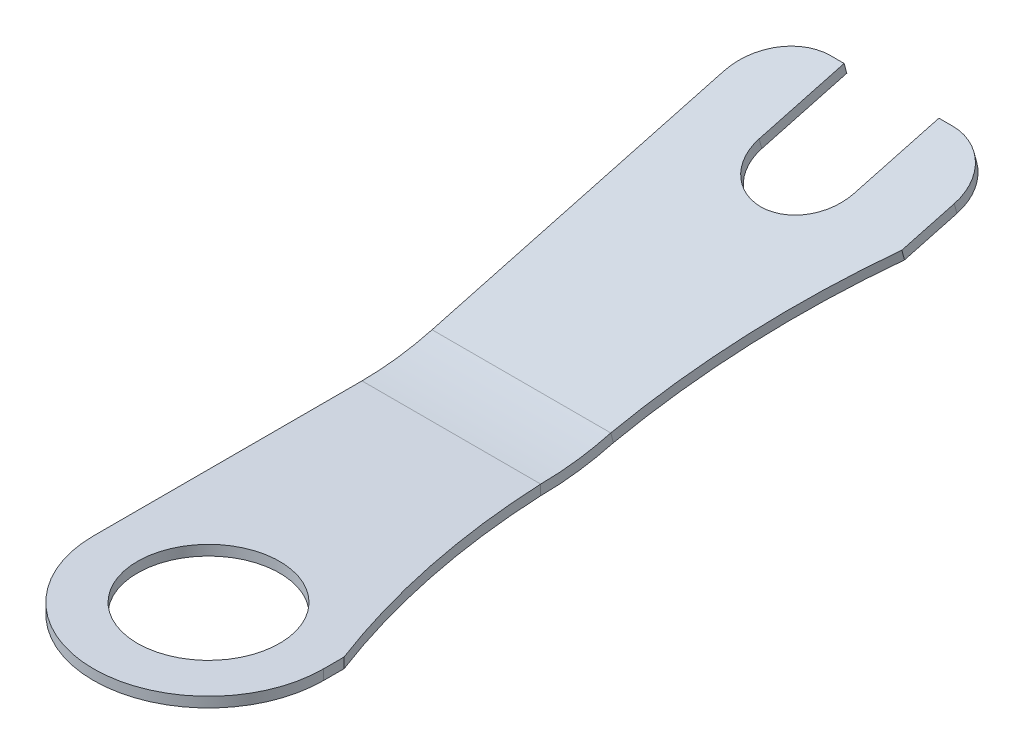
ISO-10303-21;
HEADER;
FILE_DESCRIPTION(('STEP AP214'),'2;1');
FILE_NAME('part.step','',(''),(''),'','','');
FILE_SCHEMA(('AUTOMOTIVE_DESIGN { 1 0 10303 214 1 1 1 1 }'));
ENDSEC;
DATA;
#1=APPLICATION_CONTEXT('core data for automotive mechanical design processes');
#2=APPLICATION_PROTOCOL_DEFINITION('international standard','automotive_design',2000,#1);
#3=PRODUCT_CONTEXT('',#1,'mechanical');
#4=PRODUCT('Part','Part','',(#3));
#5=PRODUCT_RELATED_PRODUCT_CATEGORY('part','',(#4));
#6=PRODUCT_DEFINITION_FORMATION('','',#4);
#7=PRODUCT_DEFINITION_CONTEXT('part definition',#1,'design');
#8=PRODUCT_DEFINITION('design','',#6,#7);
#9=PRODUCT_DEFINITION_SHAPE('','',#8);
#10=(LENGTH_UNIT() NAMED_UNIT(*) SI_UNIT(.MILLI.,.METRE.));
#11=(NAMED_UNIT(*) PLANE_ANGLE_UNIT() SI_UNIT($,.RADIAN.));
#12=(NAMED_UNIT(*) SI_UNIT($,.STERADIAN.) SOLID_ANGLE_UNIT());
#13=UNCERTAINTY_MEASURE_WITH_UNIT(LENGTH_MEASURE(1.E-05),#10,'distance_accuracy_value','');
#14=(GEOMETRIC_REPRESENTATION_CONTEXT(3) GLOBAL_UNCERTAINTY_ASSIGNED_CONTEXT((#13)) GLOBAL_UNIT_ASSIGNED_CONTEXT((#10,
#11,#12)) REPRESENTATION_CONTEXT('',''));
#15=CARTESIAN_POINT('',(0.,0.,0.));
#16=DIRECTION('',(0.,0.,1.));
#17=DIRECTION('',(1.,0.,0.));
#18=AXIS2_PLACEMENT_3D('',#15,#16,#17);
#19=CARTESIAN_POINT('',(-1.7,-1.01644729326827,-0.139953174880458));
#20=DIRECTION('',(1.,0.,0.));
#21=DIRECTION('',(0.,0.258819045102521,-0.965925826289068));
#22=AXIS2_PLACEMENT_3D('',#19,#20,#21);
#23=PLANE('',#22);
#24=DIRECTION('',(0.,-0.258819045102521,0.965925826289068));
#25=VECTOR('',#24,1.);
#26=CARTESIAN_POINT('',(-1.7,-1.16133616721163,-0.178776031645836));
#27=LINE('',#26,#25);
#28=CARTESIAN_POINT('',(-1.7,1.29744476126232,-9.35507138139198));
#29=VERTEX_POINT('',#28);
#30=CARTESIAN_POINT('',(-1.7,0.141407820900367,-5.04068278453469));
#31=VERTEX_POINT('',#30);
#32=EDGE_CURVE('E88',#29,#31,#27,.T.);
#33=ORIENTED_EDGE('',*,*,#32,.T.);
#34=DIRECTION('',(0.,0.965925826289068,0.258819045102521));
#35=VECTOR('',#34,1.);
#36=CARTESIAN_POINT('',(-1.7,0.286296694843728,-5.00185992776932));
#37=LINE('',#36,#35);
#38=CARTESIAN_POINT('',(-1.7,0.286296694843727,-5.00185992776932));
#39=VERTEX_POINT('',#38);
#40=EDGE_CURVE('E501',#31,#39,#37,.T.);
#41=ORIENTED_EDGE('',*,*,#40,.T.);
#42=DIRECTION('',(0.,-0.258819045102521,0.965925826289068));
#43=VECTOR('',#42,1.);
#44=CARTESIAN_POINT('',(-1.7,-1.01644729326827,-0.139953174880458));
#45=LINE('',#44,#43);
#46=CARTESIAN_POINT('',(-1.7,1.44233363520568,-9.3162485246266));
#47=VERTEX_POINT('',#46);
#48=EDGE_CURVE('E67',#47,#39,#45,.T.);
#49=ORIENTED_EDGE('',*,*,#48,.F.);
#50=DIRECTION('',(0.,-0.965925826289068,-0.258819045102521));
#51=VECTOR('',#50,1.);
#52=CARTESIAN_POINT('',(-1.7,1.44233363520569,-9.31624852462661));
#53=LINE('',#52,#51);
#54=EDGE_CURVE('E569',#47,#29,#53,.T.);
#55=ORIENTED_EDGE('',*,*,#54,.T.);
#56=EDGE_LOOP('',(#33,#41,#49,#55));
#57=FACE_BOUND('',#56,.T.);
#58=ADVANCED_FACE('F63',(#57),#23,.F.);
#59=CARTESIAN_POINT('',(0.,1.16803523871106,-8.87210846824745));
#60=DIRECTION('',(0.,0.965925826289068,0.258819045102521));
#61=DIRECTION('',(0.,-0.258819045102521,0.965925826289068));
#62=AXIS2_PLACEMENT_3D('',#59,#60,#61);
#63=PLANE('',#62);
#64=CARTESIAN_POINT('',(12.7279220613579,0.00334953574971861,-4.52544224994664));
#65=DIRECTION('',(0.,0.965925826289068,0.258819045102521));
#66=DIRECTION('',(0.,-0.258819045102521,0.965925826289068));
#67=AXIS2_PLACEMENT_3D('',#64,#65,#66);
#68=CIRCLE('',#67,11.8);
#69=CARTESIAN_POINT('',(1.7,1.08992524666565,-8.58059800935517));
#70=VERTEX_POINT('',#69);
#71=CARTESIAN_POINT('',(0.939984705678592,0.141407820900368,-5.0406827845347));
#72=VERTEX_POINT('',#71);
#73=EDGE_CURVE('E80',#70,#72,#68,.T.);
#74=ORIENTED_EDGE('',*,*,#73,.T.);
#75=DIRECTION('',(-1.,0.,0.));
#76=VECTOR('',#75,1.);
#77=CARTESIAN_POINT('',(0.,0.141407820900368,-5.0406827845347));
#78=LINE('',#77,#76);
#79=EDGE_CURVE('E72',#72,#31,#78,.T.);
#80=ORIENTED_EDGE('',*,*,#79,.T.);
#81=ORIENTED_EDGE('',*,*,#32,.F.);
#82=CARTESIAN_POINT('',(-0.9,1.29744476126233,-9.35507138139198));
#83=DIRECTION('',(0.,0.965925826289068,0.258819045102521));
#84=DIRECTION('',(0.,-0.258819045102521,0.965925826289068));
#85=AXIS2_PLACEMENT_3D('',#82,#83,#84);
#86=CIRCLE('',#85,0.8);
#87=CARTESIAN_POINT('',(-0.9,1.50449999734434,-10.1278120424232));
#88=VERTEX_POINT('',#87);
#89=EDGE_CURVE('E574',#29,#88,#86,.F.);
#90=ORIENTED_EDGE('',*,*,#89,.T.);
#91=DIRECTION('',(-1.,0.,0.));
#92=VECTOR('',#91,1.);
#93=CARTESIAN_POINT('',(-1.7,1.50449999734434,-10.1278120424232));
#94=LINE('',#93,#92);
#95=CARTESIAN_POINT('',(-0.7,1.50449999734434,-10.1278120424232));
#96=VERTEX_POINT('',#95);
#97=EDGE_CURVE('E551',#96,#88,#94,.T.);
#98=ORIENTED_EDGE('',*,*,#97,.F.);
#99=DIRECTION('',(0.,0.258819045102521,-0.965925826289068));
#100=VECTOR('',#99,1.);
#101=CARTESIAN_POINT('',(-0.7,1.16803523871106,-8.87210846824745));
#102=LINE('',#101,#100);
#103=CARTESIAN_POINT('',(-0.7,1.16803523871106,-8.87210846824745));
#104=VERTEX_POINT('',#103);
#105=EDGE_CURVE('E549',#104,#96,#102,.T.);
#106=ORIENTED_EDGE('',*,*,#105,.F.);
#107=CARTESIAN_POINT('',(0.,1.16803523871106,-8.87210846824745));
#108=DIRECTION('',(0.,-0.965925826289068,-0.258819045102521));
#109=DIRECTION('',(0.,-0.258819045102521,0.965925826289068));
#110=AXIS2_PLACEMENT_3D('',#107,#108,#109);
#111=CIRCLE('',#110,0.7);
#112=CARTESIAN_POINT('',(0.7,1.16803523871106,-8.87210846824745));
#113=VERTEX_POINT('',#112);
#114=EDGE_CURVE('E531',#113,#104,#111,.T.);
#115=ORIENTED_EDGE('',*,*,#114,.F.);
#116=DIRECTION('',(0.,-0.258819045102521,0.965925826289068));
#117=VECTOR('',#116,1.);
#118=CARTESIAN_POINT('',(0.7,1.16803523871106,-8.87210846824745));
#119=LINE('',#118,#117);
#120=CARTESIAN_POINT('',(0.7,1.50449999734434,-10.1278120424232));
#121=VERTEX_POINT('',#120);
#122=EDGE_CURVE('E536',#121,#113,#119,.T.);
#123=ORIENTED_EDGE('',*,*,#122,.F.);
#124=DIRECTION('',(-1.,0.,0.));
#125=VECTOR('',#124,1.);
#126=CARTESIAN_POINT('',(0.7,1.50449999734434,-10.1278120424232));
#127=LINE('',#126,#125);
#128=CARTESIAN_POINT('',(0.9,1.50449999734434,-10.1278120424232));
#129=VERTEX_POINT('',#128);
#130=EDGE_CURVE('E554',#129,#121,#127,.T.);
#131=ORIENTED_EDGE('',*,*,#130,.F.);
#132=CARTESIAN_POINT('',(0.9,1.29744476126233,-9.35507138139198));
#133=DIRECTION('',(0.,0.965925826289068,0.258819045102521));
#134=DIRECTION('',(0.,-0.258819045102521,0.965925826289068));
#135=AXIS2_PLACEMENT_3D('',#132,#133,#134);
#136=CIRCLE('',#135,0.8);
#137=CARTESIAN_POINT('',(1.7,1.29744476126232,-9.35507138139198));
#138=VERTEX_POINT('',#137);
#139=EDGE_CURVE('E571',#129,#138,#136,.F.);
#140=ORIENTED_EDGE('',*,*,#139,.T.);
#141=DIRECTION('',(0.,0.258819045102521,-0.965925826289068));
#142=VECTOR('',#141,1.);
#143=CARTESIAN_POINT('',(1.7,-1.16133616721163,-0.178776031645836));
#144=LINE('',#143,#142);
#145=EDGE_CURVE('E556',#70,#138,#144,.T.);
#146=ORIENTED_EDGE('',*,*,#145,.F.);
#147=EDGE_LOOP('',(#74,#80,#81,#90,#98,#106,#115,#123,#131,#140,#146));
#148=FACE_BOUND('',#147,.T.);
#149=ADVANCED_FACE('F305',(#148),#63,.F.);
#150=CARTESIAN_POINT('',(1.7,-1.01644729326827,-0.139953174880458));
#151=DIRECTION('',(-1.,0.,0.));
#152=DIRECTION('',(0.,-0.258819045102521,0.965925826289068));
#153=AXIS2_PLACEMENT_3D('',#150,#151,#152);
#154=PLANE('',#153);
#155=DIRECTION('',(0.,0.965925826289068,0.258819045102521));
#156=VECTOR('',#155,1.);
#157=CARTESIAN_POINT('',(1.7,1.23481412060901,-8.5417751525898));
#158=LINE('',#157,#156);
#159=CARTESIAN_POINT('',(1.7,1.23481412060901,-8.5417751525898));
#160=VERTEX_POINT('',#159);
#161=EDGE_CURVE('E529',#160,#70,#158,.F.);
#162=ORIENTED_EDGE('',*,*,#161,.T.);
#163=ORIENTED_EDGE('',*,*,#145,.T.);
#164=DIRECTION('',(0.,-0.965925826289068,-0.258819045102521));
#165=VECTOR('',#164,1.);
#166=CARTESIAN_POINT('',(1.7,1.44233363520569,-9.31624852462661));
#167=LINE('',#166,#165);
#168=CARTESIAN_POINT('',(1.7,1.44233363520568,-9.3162485246266));
#169=VERTEX_POINT('',#168);
#170=EDGE_CURVE('E585',#138,#169,#167,.F.);
#171=ORIENTED_EDGE('',*,*,#170,.T.);
#172=DIRECTION('',(0.,0.258819045102521,-0.965925826289068));
#173=VECTOR('',#172,1.);
#174=CARTESIAN_POINT('',(1.7,-1.01644729326827,-0.139953174880458));
#175=LINE('',#174,#173);
#176=EDGE_CURVE('E544',#160,#169,#175,.T.);
#177=ORIENTED_EDGE('',*,*,#176,.F.);
#178=EDGE_LOOP('',(#162,#163,#171,#177));
#179=FACE_BOUND('',#178,.T.);
#180=ADVANCED_FACE('F302',(#179),#154,.F.);
#181=CARTESIAN_POINT('',(0.,1.31292411265442,-8.83328561148207));
#182=DIRECTION('',(0.,0.965925826289068,0.258819045102521));
#183=DIRECTION('',(0.,-0.258819045102521,0.965925826289068));
#184=AXIS2_PLACEMENT_3D('',#181,#182,#183);
#185=PLANE('',#184);
#186=DIRECTION('',(-1.,0.,0.));
#187=VECTOR('',#186,1.);
#188=CARTESIAN_POINT('',(0.,0.286296694843728,-5.00185992776932));
#189=LINE('',#188,#187);
#190=CARTESIAN_POINT('',(0.939984705678592,0.286296694843728,-5.00185992776932));
#191=VERTEX_POINT('',#190);
#192=EDGE_CURVE('E216',#191,#39,#189,.T.);
#193=ORIENTED_EDGE('',*,*,#192,.F.);
#194=CARTESIAN_POINT('',(12.7279220613579,0.148238409693079,-4.48661939318126));
#195=DIRECTION('',(0.,0.965925826289068,0.258819045102521));
#196=DIRECTION('',(0.,-0.258819045102521,0.965925826289068));
#197=AXIS2_PLACEMENT_3D('',#194,#195,#196);
#198=CIRCLE('',#197,11.8);
#199=EDGE_CURVE('E499',#160,#191,#198,.T.);
#200=ORIENTED_EDGE('',*,*,#199,.F.);
#201=ORIENTED_EDGE('',*,*,#176,.T.);
#202=CARTESIAN_POINT('',(0.9,1.44233363520569,-9.31624852462661));
#203=DIRECTION('',(0.,0.965925826289068,0.258819045102521));
#204=DIRECTION('',(0.,-0.258819045102521,0.965925826289068));
#205=AXIS2_PLACEMENT_3D('',#202,#203,#204);
#206=CIRCLE('',#205,0.8);
#207=CARTESIAN_POINT('',(0.9,1.6493888712877,-10.0889891856579));
#208=VERTEX_POINT('',#207);
#209=EDGE_CURVE('E578',#169,#208,#206,.T.);
#210=ORIENTED_EDGE('',*,*,#209,.T.);
#211=DIRECTION('',(-1.,0.,0.));
#212=VECTOR('',#211,1.);
#213=CARTESIAN_POINT('',(0.7,1.6493888712877,-10.0889891856579));
#214=LINE('',#213,#212);
#215=CARTESIAN_POINT('',(0.7,1.6493888712877,-10.0889891856579));
#216=VERTEX_POINT('',#215);
#217=EDGE_CURVE('E541',#208,#216,#214,.T.);
#218=ORIENTED_EDGE('',*,*,#217,.T.);
#219=DIRECTION('',(0.,-0.258819045102521,0.965925826289068));
#220=VECTOR('',#219,1.);
#221=CARTESIAN_POINT('',(0.7,1.31292411265442,-8.83328561148207));
#222=LINE('',#221,#220);
#223=CARTESIAN_POINT('',(0.7,1.31292411265442,-8.83328561148207));
#224=VERTEX_POINT('',#223);
#225=EDGE_CURVE('E543',#216,#224,#222,.T.);
#226=ORIENTED_EDGE('',*,*,#225,.T.);
#227=CARTESIAN_POINT('',(0.,1.31292411265442,-8.83328561148207));
#228=DIRECTION('',(0.,-0.965925826289068,-0.258819045102521));
#229=DIRECTION('',(0.,-0.258819045102521,0.965925826289068));
#230=AXIS2_PLACEMENT_3D('',#227,#228,#229);
#231=CIRCLE('',#230,0.7);
#232=CARTESIAN_POINT('',(-0.7,1.31292411265442,-8.83328561148207));
#233=VERTEX_POINT('',#232);
#234=EDGE_CURVE('E532',#224,#233,#231,.T.);
#235=ORIENTED_EDGE('',*,*,#234,.T.);
#236=DIRECTION('',(0.,0.258819045102521,-0.965925826289068));
#237=VECTOR('',#236,1.);
#238=CARTESIAN_POINT('',(-0.7,1.31292411265442,-8.83328561148207));
#239=LINE('',#238,#237);
#240=CARTESIAN_POINT('',(-0.7,1.6493888712877,-10.0889891856579));
#241=VERTEX_POINT('',#240);
#242=EDGE_CURVE('E535',#233,#241,#239,.T.);
#243=ORIENTED_EDGE('',*,*,#242,.T.);
#244=DIRECTION('',(-1.,0.,0.));
#245=VECTOR('',#244,1.);
#246=CARTESIAN_POINT('',(-1.7,1.6493888712877,-10.0889891856579));
#247=LINE('',#246,#245);
#248=CARTESIAN_POINT('',(-0.9,1.6493888712877,-10.0889891856579));
#249=VERTEX_POINT('',#248);
#250=EDGE_CURVE('E538',#241,#249,#247,.T.);
#251=ORIENTED_EDGE('',*,*,#250,.T.);
#252=CARTESIAN_POINT('',(-0.9,1.44233363520569,-9.31624852462661));
#253=DIRECTION('',(0.,0.965925826289068,0.258819045102521));
#254=DIRECTION('',(0.,-0.258819045102521,0.965925826289068));
#255=AXIS2_PLACEMENT_3D('',#252,#253,#254);
#256=CIRCLE('',#255,0.8);
#257=EDGE_CURVE('E580',#249,#47,#256,.T.);
#258=ORIENTED_EDGE('',*,*,#257,.T.);
#259=ORIENTED_EDGE('',*,*,#48,.T.);
#260=EDGE_LOOP('',(#193,#200,#201,#210,#218,#226,#235,#243,#251,#258,#259));
#261=FACE_BOUND('',#260,.T.);
#262=ADVANCED_FACE('F293',(#261),#185,.T.);
#263=CARTESIAN_POINT('',(0.,1.31292411265442,-8.83328561148207));
#264=DIRECTION('',(0.,-0.965925826289068,-0.258819045102521));
#265=DIRECTION('',(0.,0.258819045102521,-0.965925826289068));
#266=AXIS2_PLACEMENT_3D('',#263,#264,#265);
#267=CYLINDRICAL_SURFACE('',#266,0.7);
#268=ORIENTED_EDGE('',*,*,#114,.T.);
#269=DIRECTION('',(0.,-0.965925826289068,-0.258819045102521));
#270=VECTOR('',#269,1.);
#271=CARTESIAN_POINT('',(-0.7,1.31292411265442,-8.83328561148207));
#272=LINE('',#271,#270);
#273=EDGE_CURVE('E566',#233,#104,#272,.T.);
#274=ORIENTED_EDGE('',*,*,#273,.F.);
#275=ORIENTED_EDGE('',*,*,#234,.F.);
#276=DIRECTION('',(0.,-0.965925826289068,-0.258819045102521));
#277=VECTOR('',#276,1.);
#278=CARTESIAN_POINT('',(0.7,1.31292411265442,-8.83328561148207));
#279=LINE('',#278,#277);
#280=EDGE_CURVE('E546',#224,#113,#279,.T.);
#281=ORIENTED_EDGE('',*,*,#280,.T.);
#282=EDGE_LOOP('',(#268,#274,#275,#281));
#283=FACE_BOUND('',#282,.T.);
#284=ADVANCED_FACE('F289',(#283),#267,.F.);
#285=CARTESIAN_POINT('',(-0.7,1.31292411265442,-8.83328561148207));
#286=DIRECTION('',(-1.,0.,0.));
#287=DIRECTION('',(0.,-0.258819045102521,0.965925826289068));
#288=AXIS2_PLACEMENT_3D('',#285,#286,#287);
#289=PLANE('',#288);
#290=ORIENTED_EDGE('',*,*,#105,.T.);
#291=DIRECTION('',(0.,-0.965925826289068,-0.258819045102521));
#292=VECTOR('',#291,1.);
#293=CARTESIAN_POINT('',(-0.7,1.6493888712877,-10.0889891856579));
#294=LINE('',#293,#292);
#295=EDGE_CURVE('E563',#241,#96,#294,.T.);
#296=ORIENTED_EDGE('',*,*,#295,.F.);
#297=ORIENTED_EDGE('',*,*,#242,.F.);
#298=ORIENTED_EDGE('',*,*,#273,.T.);
#299=EDGE_LOOP('',(#290,#296,#297,#298));
#300=FACE_BOUND('',#299,.T.);
#301=ADVANCED_FACE('F285',(#300),#289,.F.);
#302=CARTESIAN_POINT('',(-1.7,1.6493888712877,-10.0889891856579));
#303=DIRECTION('',(0.,-0.258819045102521,0.965925826289068));
#304=DIRECTION('',(1.,0.,0.));
#305=AXIS2_PLACEMENT_3D('',#302,#303,#304);
#306=PLANE('',#305);
#307=ORIENTED_EDGE('',*,*,#97,.T.);
#308=DIRECTION('',(0.,-0.965925826289068,-0.258819045102521));
#309=VECTOR('',#308,1.);
#310=CARTESIAN_POINT('',(-0.9,1.6493888712877,-10.0889891856579));
#311=LINE('',#310,#309);
#312=EDGE_CURVE('E576',#88,#249,#311,.F.);
#313=ORIENTED_EDGE('',*,*,#312,.T.);
#314=ORIENTED_EDGE('',*,*,#250,.F.);
#315=ORIENTED_EDGE('',*,*,#295,.T.);
#316=EDGE_LOOP('',(#307,#313,#314,#315));
#317=FACE_BOUND('',#316,.T.);
#318=ADVANCED_FACE('F281',(#317),#306,.F.);
#319=CARTESIAN_POINT('',(0.7,1.6493888712877,-10.0889891856579));
#320=DIRECTION('',(0.,-0.258819045102521,0.965925826289068));
#321=DIRECTION('',(1.,0.,0.));
#322=AXIS2_PLACEMENT_3D('',#319,#320,#321);
#323=PLANE('',#322);
#324=ORIENTED_EDGE('',*,*,#217,.F.);
#325=DIRECTION('',(0.,-0.965925826289068,-0.258819045102521));
#326=VECTOR('',#325,1.);
#327=CARTESIAN_POINT('',(0.9,1.6493888712877,-10.0889891856579));
#328=LINE('',#327,#326);
#329=EDGE_CURVE('E582',#208,#129,#328,.T.);
#330=ORIENTED_EDGE('',*,*,#329,.T.);
#331=ORIENTED_EDGE('',*,*,#130,.T.);
#332=DIRECTION('',(0.,-0.965925826289068,-0.258819045102521));
#333=VECTOR('',#332,1.);
#334=CARTESIAN_POINT('',(0.7,1.6493888712877,-10.0889891856579));
#335=LINE('',#334,#333);
#336=EDGE_CURVE('E560',#216,#121,#335,.T.);
#337=ORIENTED_EDGE('',*,*,#336,.F.);
#338=EDGE_LOOP('',(#324,#330,#331,#337));
#339=FACE_BOUND('',#338,.T.);
#340=ADVANCED_FACE('F277',(#339),#323,.F.);
#341=CARTESIAN_POINT('',(0.7,1.31292411265442,-8.83328561148207));
#342=DIRECTION('',(1.,0.,0.));
#343=DIRECTION('',(0.,0.258819045102521,-0.965925826289068));
#344=AXIS2_PLACEMENT_3D('',#341,#342,#343);
#345=PLANE('',#344);
#346=ORIENTED_EDGE('',*,*,#122,.T.);
#347=ORIENTED_EDGE('',*,*,#280,.F.);
#348=ORIENTED_EDGE('',*,*,#225,.F.);
#349=ORIENTED_EDGE('',*,*,#336,.T.);
#350=EDGE_LOOP('',(#346,#347,#348,#349));
#351=FACE_BOUND('',#350,.T.);
#352=ADVANCED_FACE('F273',(#351),#345,.F.);
#353=CARTESIAN_POINT('',(-0.9,1.44233363520569,-9.31624852462661));
#354=DIRECTION('',(0.,-0.965925826289068,-0.258819045102521));
#355=DIRECTION('',(0.,0.258819045102521,-0.965925826289068));
#356=AXIS2_PLACEMENT_3D('',#353,#354,#355);
#357=CYLINDRICAL_SURFACE('',#356,0.8);
#358=ORIENTED_EDGE('',*,*,#257,.F.);
#359=ORIENTED_EDGE('',*,*,#312,.F.);
#360=ORIENTED_EDGE('',*,*,#89,.F.);
#361=ORIENTED_EDGE('',*,*,#54,.F.);
#362=EDGE_LOOP('',(#358,#359,#360,#361));
#363=FACE_BOUND('',#362,.T.);
#364=ADVANCED_FACE('F276',(#363),#357,.T.);
#365=CARTESIAN_POINT('',(0.9,1.44233363520569,-9.31624852462661));
#366=DIRECTION('',(0.,-0.965925826289068,-0.258819045102521));
#367=DIRECTION('',(0.,0.258819045102521,-0.965925826289068));
#368=AXIS2_PLACEMENT_3D('',#365,#366,#367);
#369=CYLINDRICAL_SURFACE('',#368,0.8);
#370=ORIENTED_EDGE('',*,*,#209,.F.);
#371=ORIENTED_EDGE('',*,*,#170,.F.);
#372=ORIENTED_EDGE('',*,*,#139,.F.);
#373=ORIENTED_EDGE('',*,*,#329,.F.);
#374=EDGE_LOOP('',(#370,#371,#372,#373));
#375=FACE_BOUND('',#374,.T.);
#376=ADVANCED_FACE('F297',(#375),#369,.T.);
#377=CARTESIAN_POINT('',(12.7279220613579,0.148238409693079,-4.48661939318126));
#378=DIRECTION('',(0.,0.965925826289068,0.258819045102521));
#379=DIRECTION('',(0.,-0.258819045102521,0.965925826289068));
#380=AXIS2_PLACEMENT_3D('',#377,#378,#379);
#381=CYLINDRICAL_SURFACE('',#380,11.8);
#382=DIRECTION('',(0.,0.965925826289068,0.258819045102521));
#383=VECTOR('',#382,1.);
#384=CARTESIAN_POINT('',(0.93998470567859,0.286296694843728,-5.00185992776932));
#385=LINE('',#384,#383);
#386=EDGE_CURVE('E14',#72,#191,#385,.T.);
#387=ORIENTED_EDGE('',*,*,#386,.F.);
#388=ORIENTED_EDGE('',*,*,#73,.F.);
#389=ORIENTED_EDGE('',*,*,#161,.F.);
#390=ORIENTED_EDGE('',*,*,#199,.T.);
#391=EDGE_LOOP('',(#387,#388,#389,#390));
#392=FACE_BOUND('',#391,.T.);
#393=ADVANCED_FACE('F65',(#392),#381,.F.);
#394=CARTESIAN_POINT('',(1.7,0.15,0.));
#395=DIRECTION('',(-1.,0.,0.));
#396=DIRECTION('',(0.,0.,1.));
#397=AXIS2_PLACEMENT_3D('',#394,#395,#396);
#398=PLANE('',#397);
#399=DIRECTION('',(0.,1.,0.));
#400=VECTOR('',#399,1.);
#401=CARTESIAN_POINT('',(1.7,0.15,-0.301793834431583));
#402=LINE('',#401,#400);
#403=CARTESIAN_POINT('',(1.7,0.15,-0.301793834431583));
#404=VERTEX_POINT('',#403);
#405=CARTESIAN_POINT('',(1.7,0.,-0.301793834431583));
#406=VERTEX_POINT('',#405);
#407=EDGE_CURVE('E507',#404,#406,#402,.F.);
#408=ORIENTED_EDGE('',*,*,#407,.F.);
#409=DIRECTION('',(0.,0.,-1.));
#410=VECTOR('',#409,1.);
#411=CARTESIAN_POINT('',(1.7,0.15,0.));
#412=LINE('',#411,#410);
#413=CARTESIAN_POINT('',(1.7,0.15,0.));
#414=VERTEX_POINT('',#413);
#415=EDGE_CURVE('E516',#414,#404,#412,.T.);
#416=ORIENTED_EDGE('',*,*,#415,.F.);
#417=DIRECTION('',(0.,-1.,0.));
#418=VECTOR('',#417,1.);
#419=CARTESIAN_POINT('',(1.7,0.15,0.));
#420=LINE('',#419,#418);
#421=CARTESIAN_POINT('',(1.7,0.,0.));
#422=VERTEX_POINT('',#421);
#423=EDGE_CURVE('E211',#414,#422,#420,.T.);
#424=ORIENTED_EDGE('',*,*,#423,.T.);
#425=DIRECTION('',(0.,0.,-1.));
#426=VECTOR('',#425,1.);
#427=CARTESIAN_POINT('',(1.7,0.,0.));
#428=LINE('',#427,#426);
#429=EDGE_CURVE('E524',#422,#406,#428,.T.);
#430=ORIENTED_EDGE('',*,*,#429,.T.);
#431=EDGE_LOOP('',(#408,#416,#424,#430));
#432=FACE_BOUND('',#431,.T.);
#433=ADVANCED_FACE('F249',(#432),#398,.F.);
#434=CARTESIAN_POINT('',(0.,0.15,0.));
#435=DIRECTION('',(0.,-1.,0.));
#436=DIRECTION('',(0.,0.,-1.));
#437=AXIS2_PLACEMENT_3D('',#434,#435,#436);
#438=CYLINDRICAL_SURFACE('',#437,1.7);
#439=CARTESIAN_POINT('',(0.,0.,0.));
#440=DIRECTION('',(0.,1.,0.));
#441=DIRECTION('',(0.,0.,1.));
#442=AXIS2_PLACEMENT_3D('',#439,#440,#441);
#443=CIRCLE('',#442,1.7);
#444=CARTESIAN_POINT('',(-1.7,0.,0.));
#445=VERTEX_POINT('',#444);
#446=EDGE_CURVE('E522',#445,#422,#443,.T.);
#447=ORIENTED_EDGE('',*,*,#446,.T.);
#448=ORIENTED_EDGE('',*,*,#423,.F.);
#449=CARTESIAN_POINT('',(0.,0.15,0.));
#450=DIRECTION('',(0.,1.,0.));
#451=DIRECTION('',(0.,0.,1.));
#452=AXIS2_PLACEMENT_3D('',#449,#450,#451);
#453=CIRCLE('',#452,1.7);
#454=CARTESIAN_POINT('',(-1.7,0.15,0.));
#455=VERTEX_POINT('',#454);
#456=EDGE_CURVE('E189',#455,#414,#453,.T.);
#457=ORIENTED_EDGE('',*,*,#456,.F.);
#458=DIRECTION('',(0.,-1.,0.));
#459=VECTOR('',#458,1.);
#460=CARTESIAN_POINT('',(-1.7,0.15,0.));
#461=LINE('',#460,#459);
#462=EDGE_CURVE('E186',#455,#445,#461,.T.);
#463=ORIENTED_EDGE('',*,*,#462,.T.);
#464=EDGE_LOOP('',(#447,#448,#457,#463));
#465=FACE_BOUND('',#464,.T.);
#466=ADVANCED_FACE('F252',(#465),#438,.T.);
#467=CARTESIAN_POINT('',(0.,0.15,0.));
#468=DIRECTION('',(0.,-1.,0.));
#469=DIRECTION('',(0.,0.,-1.));
#470=AXIS2_PLACEMENT_3D('',#467,#468,#469);
#471=CYLINDRICAL_SURFACE('',#470,1.05);
#472=CARTESIAN_POINT('',(0.,0.15,0.));
#473=DIRECTION('',(0.,1.,0.));
#474=DIRECTION('',(0.,0.,1.));
#475=AXIS2_PLACEMENT_3D('',#472,#473,#474);
#476=CIRCLE('',#475,1.05);
#477=CARTESIAN_POINT('',(0.,0.15,1.05));
#478=VERTEX_POINT('',#477);
#479=EDGE_CURVE('E201',#478,#478,#476,.T.);
#480=ORIENTED_EDGE('',*,*,#479,.T.);
#481=EDGE_LOOP('',(#480));
#482=FACE_BOUND('',#481,.T.);
#483=CARTESIAN_POINT('',(0.,0.,0.));
#484=DIRECTION('',(0.,1.,0.));
#485=DIRECTION('',(0.,0.,1.));
#486=AXIS2_PLACEMENT_3D('',#483,#484,#485);
#487=CIRCLE('',#486,1.05);
#488=CARTESIAN_POINT('',(0.,0.,1.05));
#489=VERTEX_POINT('',#488);
#490=EDGE_CURVE('E505',#489,#489,#487,.T.);
#491=ORIENTED_EDGE('',*,*,#490,.F.);
#492=EDGE_LOOP('',(#491));
#493=FACE_BOUND('',#492,.T.);
#494=ADVANCED_FACE('F256',(#482,#493),#471,.F.);
#495=CARTESIAN_POINT('',(0.,0.15,-9.));
#496=DIRECTION('',(0.,1.,0.));
#497=DIRECTION('',(0.,0.,1.));
#498=AXIS2_PLACEMENT_3D('',#495,#496,#497);
#499=PLANE('',#498);
#500=ORIENTED_EDGE('',*,*,#479,.F.);
#501=EDGE_LOOP('',(#500));
#502=FACE_BOUND('',#501,.T.);
#503=CARTESIAN_POINT('',(12.7279220613579,0.15,-4.5));
#504=DIRECTION('',(0.,1.,0.));
#505=DIRECTION('',(0.,0.,1.));
#506=AXIS2_PLACEMENT_3D('',#503,#504,#505);
#507=CIRCLE('',#506,11.8);
#508=CARTESIAN_POINT('',(0.93998470567859,0.15,-3.96658374735923));
#509=VERTEX_POINT('',#508);
#510=EDGE_CURVE('E195',#509,#404,#507,.T.);
#511=ORIENTED_EDGE('',*,*,#510,.F.);
#512=DIRECTION('',(-1.,0.,0.));
#513=VECTOR('',#512,1.);
#514=CARTESIAN_POINT('',(0.,0.15,-3.96658374735923));
#515=LINE('',#514,#513);
#516=CARTESIAN_POINT('',(-1.7,0.15,-3.96658374735923));
#517=VERTEX_POINT('',#516);
#518=EDGE_CURVE('E190',#509,#517,#515,.T.);
#519=ORIENTED_EDGE('',*,*,#518,.T.);
#520=DIRECTION('',(0.,0.,1.));
#521=VECTOR('',#520,1.);
#522=CARTESIAN_POINT('',(-1.7,0.15,0.));
#523=LINE('',#522,#521);
#524=EDGE_CURVE('E179',#517,#455,#523,.T.);
#525=ORIENTED_EDGE('',*,*,#524,.T.);
#526=ORIENTED_EDGE('',*,*,#456,.T.);
#527=ORIENTED_EDGE('',*,*,#415,.T.);
#528=EDGE_LOOP('',(#511,#519,#525,#526,#527));
#529=FACE_BOUND('',#528,.T.);
#530=ADVANCED_FACE('F193',(#502,#529),#499,.T.);
#531=CARTESIAN_POINT('',(-1.7,0.15,0.));
#532=DIRECTION('',(1.,0.,0.));
#533=DIRECTION('',(0.,0.,-1.));
#534=AXIS2_PLACEMENT_3D('',#531,#532,#533);
#535=PLANE('',#534);
#536=DIRECTION('',(0.,1.,0.));
#537=VECTOR('',#536,1.);
#538=CARTESIAN_POINT('',(-1.7,0.15,-3.96658374735923));
#539=LINE('',#538,#537);
#540=CARTESIAN_POINT('',(-1.7,0.,-3.96658374735923));
#541=VERTEX_POINT('',#540);
#542=EDGE_CURVE('E183',#541,#517,#539,.T.);
#543=ORIENTED_EDGE('',*,*,#542,.F.);
#544=DIRECTION('',(0.,0.,1.));
#545=VECTOR('',#544,1.);
#546=CARTESIAN_POINT('',(-1.7,0.,0.));
#547=LINE('',#546,#545);
#548=EDGE_CURVE('E514',#541,#445,#547,.T.);
#549=ORIENTED_EDGE('',*,*,#548,.T.);
#550=ORIENTED_EDGE('',*,*,#462,.F.);
#551=ORIENTED_EDGE('',*,*,#524,.F.);
#552=EDGE_LOOP('',(#543,#549,#550,#551));
#553=FACE_BOUND('',#552,.T.);
#554=ADVANCED_FACE('F181',(#553),#535,.F.);
#555=CARTESIAN_POINT('',(0.,0.,-9.));
#556=DIRECTION('',(0.,1.,0.));
#557=DIRECTION('',(0.,0.,1.));
#558=AXIS2_PLACEMENT_3D('',#555,#556,#557);
#559=PLANE('',#558);
#560=DIRECTION('',(-1.,0.,0.));
#561=VECTOR('',#560,1.);
#562=CARTESIAN_POINT('',(0.,0.,-3.96658374735923));
#563=LINE('',#562,#561);
#564=CARTESIAN_POINT('',(0.93998470567859,0.,-3.96658374735923));
#565=VERTEX_POINT('',#564);
#566=EDGE_CURVE('E212',#565,#541,#563,.T.);
#567=ORIENTED_EDGE('',*,*,#566,.F.);
#568=CARTESIAN_POINT('',(12.7279220613579,0.,-4.5));
#569=DIRECTION('',(0.,1.,0.));
#570=DIRECTION('',(0.,0.,1.));
#571=AXIS2_PLACEMENT_3D('',#568,#569,#570);
#572=CIRCLE('',#571,11.8);
#573=EDGE_CURVE('E510',#565,#406,#572,.T.);
#574=ORIENTED_EDGE('',*,*,#573,.T.);
#575=ORIENTED_EDGE('',*,*,#429,.F.);
#576=ORIENTED_EDGE('',*,*,#446,.F.);
#577=ORIENTED_EDGE('',*,*,#548,.F.);
#578=EDGE_LOOP('',(#567,#574,#575,#576,#577));
#579=FACE_BOUND('',#578,.T.);
#580=ORIENTED_EDGE('',*,*,#490,.T.);
#581=EDGE_LOOP('',(#580));
#582=FACE_BOUND('',#581,.T.);
#583=ADVANCED_FACE('F266',(#579,#582),#559,.F.);
#584=CARTESIAN_POINT('',(12.7279220613579,0.15,-4.5));
#585=DIRECTION('',(0.,1.,0.));
#586=DIRECTION('',(0.,0.,1.));
#587=AXIS2_PLACEMENT_3D('',#584,#585,#586);
#588=CYLINDRICAL_SURFACE('',#587,11.8);
#589=ORIENTED_EDGE('',*,*,#573,.F.);
#590=DIRECTION('',(0.,1.,0.));
#591=VECTOR('',#590,1.);
#592=CARTESIAN_POINT('',(0.93998470567859,0.15,-3.96658374735923));
#593=LINE('',#592,#591);
#594=EDGE_CURVE('E504',#565,#509,#593,.T.);
#595=ORIENTED_EDGE('',*,*,#594,.T.);
#596=ORIENTED_EDGE('',*,*,#510,.T.);
#597=ORIENTED_EDGE('',*,*,#407,.T.);
#598=EDGE_LOOP('',(#589,#595,#596,#597));
#599=FACE_BOUND('',#598,.T.);
#600=ADVANCED_FACE('F245',(#599),#588,.F.);
#601=CARTESIAN_POINT('',(0.93998470567859,4.15,-3.96658374735923));
#602=DIRECTION('',(1.,0.,0.));
#603=DIRECTION('',(0.,0.,-1.));
#604=AXIS2_PLACEMENT_3D('',#601,#602,#603);
#605=PLANE('',#604);
#606=ORIENTED_EDGE('',*,*,#594,.F.);
#607=CARTESIAN_POINT('',(0.93998470567859,0.,-3.96658374735923));
#608=CARTESIAN_POINT('',(0.93998470567859,-2.84607707107621E-07,-4.0118532338394));
#609=CARTESIAN_POINT('',(0.93998470567859,0.000740709964884903,-4.05712270421414));
#610=CARTESIAN_POINT('',(0.93998470567859,0.00370321398127928,-4.14761317792507));
#611=CARTESIAN_POINT('',(0.93998470567859,0.00592472342508166,-4.19283418126126));
#612=CARTESIAN_POINT('',(0.93998470567859,0.0118462136945089,-4.28317928606739));
#613=CARTESIAN_POINT('',(0.93998470567859,0.0155461945201337,-4.32830338753734));
#614=CARTESIAN_POINT('',(0.93998470567859,0.0244205741006329,-4.41840637191648));
#615=CARTESIAN_POINT('',(0.93998470567859,0.0295949728555073,-4.46338525482568));
#616=CARTESIAN_POINT('',(0.93998470567859,0.0414126777418669,-4.55314963531922));
#617=CARTESIAN_POINT('',(0.93998470567859,0.0480559838733522,-4.59793513290356));
#618=CARTESIAN_POINT('',(0.93998470567859,0.0628043598221529,-4.68726479099));
#619=CARTESIAN_POINT('',(0.93998470567859,0.0709094296394683,-4.73180895149209));
#620=CARTESIAN_POINT('',(0.93998470567859,0.088572743013721,-4.82060821596025));
#621=CARTESIAN_POINT('',(0.93998470567859,0.0981309865706582,-4.86486331992631));
#622=CARTESIAN_POINT('',(0.93998470567859,0.118690085427476,-4.95303715797746));
#623=CARTESIAN_POINT('',(0.93998470567859,0.129690940727356,-4.99695589206256));
#624=CARTESIAN_POINT('',(0.93998470567859,0.141407820900368,-5.0406827845347));
#625=B_SPLINE_CURVE_WITH_KNOTS('',3,(#607,#608,#609,#610,#611,#612,#613,#614,#615,#616,#617,
#618,#619,#620,#621,#622,#623,#624),.UNSPECIFIED.,.F.,.F.,(4,2,2,2,2,2,2,2,4),(0.,
0.135802372499841,0.271604744999682,0.407407117499523,0.543209489999364,0.679011862499205,
0.814814234999046,0.950616607498887,1.08641897999873),.UNSPECIFIED.);
#626=EDGE_CURVE('E225',#565,#72,#625,.T.);
#627=ORIENTED_EDGE('',*,*,#626,.T.);
#628=ORIENTED_EDGE('',*,*,#386,.T.);
#629=CARTESIAN_POINT('',(0.93998470567859,0.15,-3.96658374735923));
#630=CARTESIAN_POINT('',(0.93998470567859,0.149999725679318,-4.01021698734011));
#631=CARTESIAN_POINT('',(0.93998470567859,0.150713937315552,-4.0538502117977));
#632=CARTESIAN_POINT('',(0.93998470567859,0.153569362873522,-4.14106994549498));
#633=CARTESIAN_POINT('',(0.93998470567859,0.15571057679526,-4.18465645473468));
#634=CARTESIAN_POINT('',(0.93998470567859,0.161418037295912,-4.27173607382493));
#635=CARTESIAN_POINT('',(0.93998470567859,0.164984283874827,-4.31522918367548));
#636=CARTESIAN_POINT('',(0.93998470567859,0.173537902747598,-4.40207543367947));
#637=CARTESIAN_POINT('',(0.93998470567859,0.178525275041453,-4.44542857383292));
#638=CARTESIAN_POINT('',(0.93998470567859,0.189915833968065,-4.53194845864597));
#639=CARTESIAN_POINT('',(0.93998470567859,0.196319020600822,-4.57511520330557));
#640=CARTESIAN_POINT('',(0.93998470567859,0.210534322720148,-4.66121607856961));
#641=CARTESIAN_POINT('',(0.93998470567859,0.218346438206717,-4.70415020917404));
#642=CARTESIAN_POINT('',(0.93998470567859,0.235371318567442,-4.78973986167346));
#643=CARTESIAN_POINT('',(0.93998470567859,0.244584083441598,-4.83239538356846));
#644=CARTESIAN_POINT('',(0.93998470567859,0.264400082339735,-4.917382215425));
#645=CARTESIAN_POINT('',(0.93998470567859,0.275003316363716,-4.95971352538653));
#646=CARTESIAN_POINT('',(0.93998470567859,0.286296694843729,-5.00185992776932));
#647=B_SPLINE_CURVE_WITH_KNOTS('',3,(#629,#630,#631,#632,#633,#634,#635,#636,#637,#638,#639,
#640,#641,#642,#643,#644,#645,#646),.UNSPECIFIED.,.F.,.F.,(4,2,2,2,2,2,2,2,4),(0.,
0.130893853011894,0.26178770602379,0.392681559035685,0.52357541204758,0.654469265059474,
0.785363118071369,0.916256971083265,1.04715082409516),.UNSPECIFIED.);
#648=EDGE_CURVE('E217',#509,#191,#647,.T.);
#649=ORIENTED_EDGE('',*,*,#648,.F.);
#650=EDGE_LOOP('',(#606,#627,#628,#649));
#651=FACE_BOUND('',#650,.T.);
#652=ADVANCED_FACE('F242',(#651),#605,.T.);
#653=CARTESIAN_POINT('',(-1.7,4.15,-3.96658374735923));
#654=DIRECTION('',(1.,0.,0.));
#655=DIRECTION('',(0.,0.,-1.));
#656=AXIS2_PLACEMENT_3D('',#653,#654,#655);
#657=PLANE('',#656);
#658=CARTESIAN_POINT('',(-1.7,4.15,-3.96658374735923));
#659=DIRECTION('',(-1.,0.,0.));
#660=DIRECTION('',(0.,0.,1.));
#661=AXIS2_PLACEMENT_3D('',#658,#659,#660);
#662=CIRCLE('',#661,4.15);
#663=EDGE_CURVE('E210',#31,#541,#662,.T.);
#664=ORIENTED_EDGE('',*,*,#663,.T.);
#665=ORIENTED_EDGE('',*,*,#542,.T.);
#666=CARTESIAN_POINT('',(-1.7,4.15,-3.96658374735923));
#667=DIRECTION('',(-1.,0.,0.));
#668=DIRECTION('',(0.,0.,1.));
#669=AXIS2_PLACEMENT_3D('',#666,#667,#668);
#670=CIRCLE('',#669,4.);
#671=EDGE_CURVE('E208',#39,#517,#670,.T.);
#672=ORIENTED_EDGE('',*,*,#671,.F.);
#673=ORIENTED_EDGE('',*,*,#40,.F.);
#674=EDGE_LOOP('',(#664,#665,#672,#673));
#675=FACE_BOUND('',#674,.T.);
#676=ADVANCED_FACE('F206',(#675),#657,.F.);
#677=CARTESIAN_POINT('',(2.47133428963715,4.15,-3.96658374735923));
#678=DIRECTION('',(-1.,0.,0.));
#679=DIRECTION('',(0.,0.,1.));
#680=AXIS2_PLACEMENT_3D('',#677,#678,#679);
#681=CYLINDRICAL_SURFACE('',#680,4.);
#682=ORIENTED_EDGE('',*,*,#192,.T.);
#683=ORIENTED_EDGE('',*,*,#671,.T.);
#684=ORIENTED_EDGE('',*,*,#518,.F.);
#685=ORIENTED_EDGE('',*,*,#648,.T.);
#686=EDGE_LOOP('',(#682,#683,#684,#685));
#687=FACE_BOUND('',#686,.T.);
#688=ADVANCED_FACE('F215',(#687),#681,.F.);
#689=CARTESIAN_POINT('',(2.47133428963715,4.15,-3.96658374735923));
#690=DIRECTION('',(-1.,0.,0.));
#691=DIRECTION('',(0.,0.,1.));
#692=AXIS2_PLACEMENT_3D('',#689,#690,#691);
#693=CYLINDRICAL_SURFACE('',#692,4.15);
#694=ORIENTED_EDGE('',*,*,#79,.F.);
#695=ORIENTED_EDGE('',*,*,#626,.F.);
#696=ORIENTED_EDGE('',*,*,#566,.T.);
#697=ORIENTED_EDGE('',*,*,#663,.F.);
#698=EDGE_LOOP('',(#694,#695,#696,#697));
#699=FACE_BOUND('',#698,.T.);
#700=ADVANCED_FACE('F231',(#699),#693,.T.);
#701=CLOSED_SHELL('',(#58,#149,#180,#262,#284,#301,#318,#340,#352,#364,#376,#393,#433,#466,#494,
#530,#554,#583,#600,#652,#676,#688,#700));
#702=MANIFOLD_SOLID_BREP('B2',#701);
#703=ADVANCED_BREP_SHAPE_REPRESENTATION('',(#18,#702),#14);
#704=SHAPE_DEFINITION_REPRESENTATION(#9,#703);
ENDSEC;
END-ISO-10303-21;
